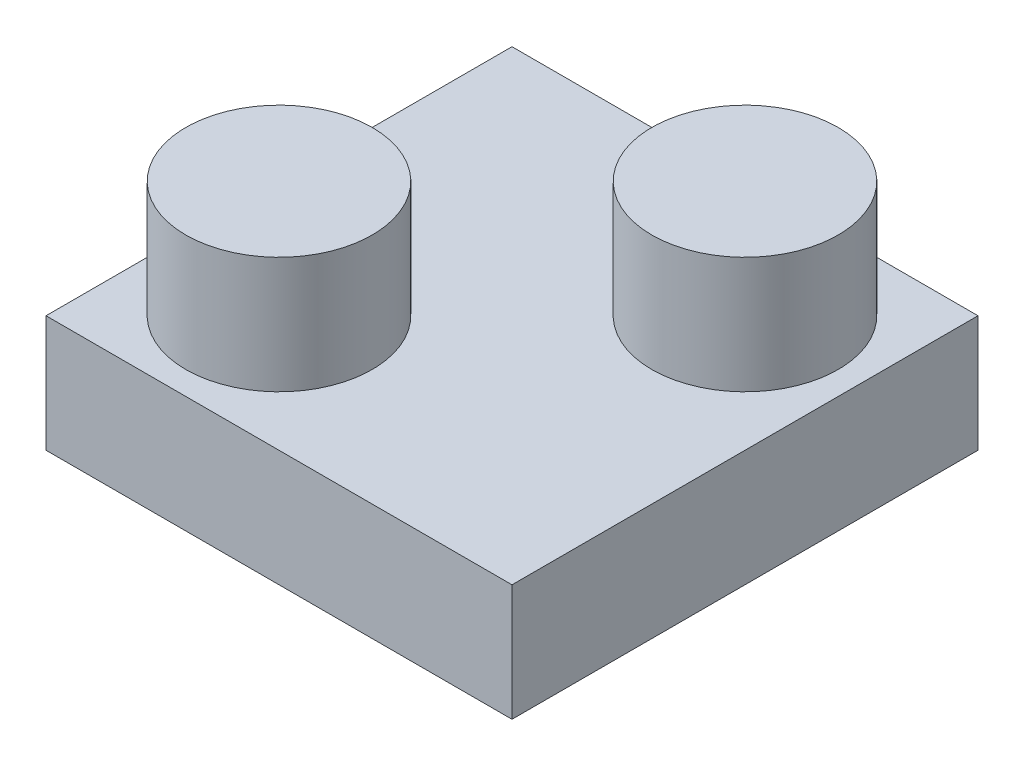
ISO-10303-21;
HEADER;
FILE_DESCRIPTION(('STEP AP214'),'2;1');
FILE_NAME('part.step','',(''),(''),'','','');
FILE_SCHEMA(('AUTOMOTIVE_DESIGN { 1 0 10303 214 1 1 1 1 }'));
ENDSEC;
DATA;
#1=APPLICATION_CONTEXT('core data for automotive mechanical design processes');
#2=APPLICATION_PROTOCOL_DEFINITION('international standard','automotive_design',2000,#1);
#3=PRODUCT_CONTEXT('',#1,'mechanical');
#4=PRODUCT('Part','Part','',(#3));
#5=PRODUCT_RELATED_PRODUCT_CATEGORY('part','',(#4));
#6=PRODUCT_DEFINITION_FORMATION('','',#4);
#7=PRODUCT_DEFINITION_CONTEXT('part definition',#1,'design');
#8=PRODUCT_DEFINITION('design','',#6,#7);
#9=PRODUCT_DEFINITION_SHAPE('','',#8);
#10=(LENGTH_UNIT() NAMED_UNIT(*) SI_UNIT(.MILLI.,.METRE.));
#11=(NAMED_UNIT(*) PLANE_ANGLE_UNIT() SI_UNIT($,.RADIAN.));
#12=(NAMED_UNIT(*) SI_UNIT($,.STERADIAN.) SOLID_ANGLE_UNIT());
#13=UNCERTAINTY_MEASURE_WITH_UNIT(LENGTH_MEASURE(1.E-05),#10,'distance_accuracy_value','');
#14=(GEOMETRIC_REPRESENTATION_CONTEXT(3) GLOBAL_UNCERTAINTY_ASSIGNED_CONTEXT((#13)) GLOBAL_UNIT_ASSIGNED_CONTEXT((#10,
#11,#12)) REPRESENTATION_CONTEXT('',''));
#15=CARTESIAN_POINT('',(0.,0.,0.));
#16=DIRECTION('',(0.,0.,1.));
#17=DIRECTION('',(1.,0.,0.));
#18=AXIS2_PLACEMENT_3D('',#15,#16,#17);
#19=CARTESIAN_POINT('',(-5.,5.,5.));
#20=DIRECTION('',(1.,0.,0.));
#21=DIRECTION('',(0.,0.,-1.));
#22=AXIS2_PLACEMENT_3D('',#19,#20,#21);
#23=PLANE('',#22);
#24=DIRECTION('',(0.,-1.,0.));
#25=VECTOR('',#24,1.);
#26=CARTESIAN_POINT('',(-5.,5.,5.));
#27=LINE('',#26,#25);
#28=CARTESIAN_POINT('',(-5.,2.5,5.));
#29=VERTEX_POINT('',#28);
#30=CARTESIAN_POINT('',(-5.,0.,5.));
#31=VERTEX_POINT('',#30);
#32=EDGE_CURVE('E11',#29,#31,#27,.T.);
#33=ORIENTED_EDGE('',*,*,#32,.F.);
#34=DIRECTION('',(0.,0.,1.));
#35=VECTOR('',#34,1.);
#36=CARTESIAN_POINT('',(-5.,2.5,5.));
#37=LINE('',#36,#35);
#38=CARTESIAN_POINT('',(-5.,2.5,-5.));
#39=VERTEX_POINT('',#38);
#40=EDGE_CURVE('E79',#39,#29,#37,.T.);
#41=ORIENTED_EDGE('',*,*,#40,.F.);
#42=DIRECTION('',(0.,-1.,0.));
#43=VECTOR('',#42,1.);
#44=CARTESIAN_POINT('',(-5.,5.,-5.));
#45=LINE('',#44,#43);
#46=CARTESIAN_POINT('',(-5.,0.,-5.));
#47=VERTEX_POINT('',#46);
#48=EDGE_CURVE('E61',#39,#47,#45,.T.);
#49=ORIENTED_EDGE('',*,*,#48,.T.);
#50=DIRECTION('',(0.,0.,1.));
#51=VECTOR('',#50,1.);
#52=CARTESIAN_POINT('',(-5.,0.,5.));
#53=LINE('',#52,#51);
#54=EDGE_CURVE('E116',#47,#31,#53,.T.);
#55=ORIENTED_EDGE('',*,*,#54,.T.);
#56=EDGE_LOOP('',(#33,#41,#49,#55));
#57=FACE_BOUND('',#56,.T.);
#58=ADVANCED_FACE('F38',(#57),#23,.F.);
#59=CARTESIAN_POINT('',(5.,5.,5.));
#60=DIRECTION('',(0.,0.,-1.));
#61=DIRECTION('',(-1.,0.,0.));
#62=AXIS2_PLACEMENT_3D('',#59,#60,#61);
#63=PLANE('',#62);
#64=DIRECTION('',(0.,-1.,0.));
#65=VECTOR('',#64,1.);
#66=CARTESIAN_POINT('',(5.,5.,5.));
#67=LINE('',#66,#65);
#68=CARTESIAN_POINT('',(5.,2.5,5.));
#69=VERTEX_POINT('',#68);
#70=CARTESIAN_POINT('',(5.,0.,5.));
#71=VERTEX_POINT('',#70);
#72=EDGE_CURVE('E46',#69,#71,#67,.T.);
#73=ORIENTED_EDGE('',*,*,#72,.F.);
#74=DIRECTION('',(1.,0.,0.));
#75=VECTOR('',#74,1.);
#76=CARTESIAN_POINT('',(5.,2.5,5.));
#77=LINE('',#76,#75);
#78=EDGE_CURVE('E88',#29,#69,#77,.T.);
#79=ORIENTED_EDGE('',*,*,#78,.F.);
#80=ORIENTED_EDGE('',*,*,#32,.T.);
#81=DIRECTION('',(1.,0.,0.));
#82=VECTOR('',#81,1.);
#83=CARTESIAN_POINT('',(5.,0.,5.));
#84=LINE('',#83,#82);
#85=EDGE_CURVE('E112',#31,#71,#84,.T.);
#86=ORIENTED_EDGE('',*,*,#85,.T.);
#87=EDGE_LOOP('',(#73,#79,#80,#86));
#88=FACE_BOUND('',#87,.T.);
#89=ADVANCED_FACE('F113',(#88),#63,.F.);
#90=CARTESIAN_POINT('',(5.,5.,5.));
#91=DIRECTION('',(-1.,0.,0.));
#92=DIRECTION('',(0.,0.,1.));
#93=AXIS2_PLACEMENT_3D('',#90,#91,#92);
#94=PLANE('',#93);
#95=DIRECTION('',(0.,-1.,0.));
#96=VECTOR('',#95,1.);
#97=CARTESIAN_POINT('',(5.,5.,-5.));
#98=LINE('',#97,#96);
#99=CARTESIAN_POINT('',(5.,2.5,-5.));
#100=VERTEX_POINT('',#99);
#101=CARTESIAN_POINT('',(5.,0.,-5.));
#102=VERTEX_POINT('',#101);
#103=EDGE_CURVE('E95',#100,#102,#98,.T.);
#104=ORIENTED_EDGE('',*,*,#103,.F.);
#105=DIRECTION('',(0.,0.,-1.));
#106=VECTOR('',#105,1.);
#107=CARTESIAN_POINT('',(5.,2.5,5.));
#108=LINE('',#107,#106);
#109=EDGE_CURVE('E53',#69,#100,#108,.T.);
#110=ORIENTED_EDGE('',*,*,#109,.F.);
#111=ORIENTED_EDGE('',*,*,#72,.T.);
#112=DIRECTION('',(0.,0.,-1.));
#113=VECTOR('',#112,1.);
#114=CARTESIAN_POINT('',(5.,0.,5.));
#115=LINE('',#114,#113);
#116=EDGE_CURVE('E100',#71,#102,#115,.T.);
#117=ORIENTED_EDGE('',*,*,#116,.T.);
#118=EDGE_LOOP('',(#104,#110,#111,#117));
#119=FACE_BOUND('',#118,.T.);
#120=ADVANCED_FACE('F108',(#119),#94,.F.);
#121=CARTESIAN_POINT('',(5.,5.,-5.));
#122=DIRECTION('',(0.,0.,1.));
#123=DIRECTION('',(1.,0.,0.));
#124=AXIS2_PLACEMENT_3D('',#121,#122,#123);
#125=PLANE('',#124);
#126=ORIENTED_EDGE('',*,*,#48,.F.);
#127=DIRECTION('',(-1.,0.,0.));
#128=VECTOR('',#127,1.);
#129=CARTESIAN_POINT('',(5.,2.5,-5.));
#130=LINE('',#129,#128);
#131=EDGE_CURVE('E77',#100,#39,#130,.T.);
#132=ORIENTED_EDGE('',*,*,#131,.F.);
#133=ORIENTED_EDGE('',*,*,#103,.T.);
#134=DIRECTION('',(-1.,0.,0.));
#135=VECTOR('',#134,1.);
#136=CARTESIAN_POINT('',(5.,0.,-5.));
#137=LINE('',#136,#135);
#138=EDGE_CURVE('E92',#102,#47,#137,.T.);
#139=ORIENTED_EDGE('',*,*,#138,.T.);
#140=EDGE_LOOP('',(#126,#132,#133,#139));
#141=FACE_BOUND('',#140,.T.);
#142=ADVANCED_FACE('F90',(#141),#125,.F.);
#143=CARTESIAN_POINT('',(0.,0.,0.));
#144=DIRECTION('',(0.,1.,0.));
#145=DIRECTION('',(0.,0.,1.));
#146=AXIS2_PLACEMENT_3D('',#143,#144,#145);
#147=PLANE('',#146);
#148=ORIENTED_EDGE('',*,*,#54,.F.);
#149=ORIENTED_EDGE('',*,*,#138,.F.);
#150=ORIENTED_EDGE('',*,*,#116,.F.);
#151=ORIENTED_EDGE('',*,*,#85,.F.);
#152=EDGE_LOOP('',(#148,#149,#150,#151));
#153=FACE_BOUND('',#152,.T.);
#154=ADVANCED_FACE('F118',(#153),#147,.F.);
#155=CARTESIAN_POINT('',(0.,2.5,0.));
#156=DIRECTION('',(0.,-1.,0.));
#157=DIRECTION('',(0.,0.,-1.));
#158=AXIS2_PLACEMENT_3D('',#155,#156,#157);
#159=PLANE('',#158);
#160=CARTESIAN_POINT('',(2.5,2.5,-2.5));
#161=DIRECTION('',(0.,1.,0.));
#162=DIRECTION('',(0.,0.,1.));
#163=AXIS2_PLACEMENT_3D('',#160,#161,#162);
#164=CIRCLE('',#163,2.);
#165=CARTESIAN_POINT('',(2.5,2.5,-0.5));
#166=VERTEX_POINT('',#165);
#167=EDGE_CURVE('E131',#166,#166,#164,.T.);
#168=ORIENTED_EDGE('',*,*,#167,.F.);
#169=EDGE_LOOP('',(#168));
#170=FACE_BOUND('',#169,.T.);
#171=CARTESIAN_POINT('',(-2.5,2.5,2.5));
#172=DIRECTION('',(0.,1.,0.));
#173=DIRECTION('',(0.,0.,1.));
#174=AXIS2_PLACEMENT_3D('',#171,#172,#173);
#175=CIRCLE('',#174,2.);
#176=CARTESIAN_POINT('',(-2.5,2.5,4.5));
#177=VERTEX_POINT('',#176);
#178=EDGE_CURVE('E84',#177,#177,#175,.T.);
#179=ORIENTED_EDGE('',*,*,#178,.F.);
#180=EDGE_LOOP('',(#179));
#181=FACE_BOUND('',#180,.T.);
#182=ORIENTED_EDGE('',*,*,#131,.T.);
#183=ORIENTED_EDGE('',*,*,#40,.T.);
#184=ORIENTED_EDGE('',*,*,#78,.T.);
#185=ORIENTED_EDGE('',*,*,#109,.T.);
#186=EDGE_LOOP('',(#182,#183,#184,#185));
#187=FACE_BOUND('',#186,.T.);
#188=ADVANCED_FACE('F78',(#170,#181,#187),#159,.F.);
#189=CARTESIAN_POINT('',(-2.5,2.5,2.5));
#190=DIRECTION('',(0.,1.,0.));
#191=DIRECTION('',(0.,0.,1.));
#192=AXIS2_PLACEMENT_3D('',#189,#190,#191);
#193=CYLINDRICAL_SURFACE('',#192,2.);
#194=ORIENTED_EDGE('',*,*,#178,.T.);
#195=EDGE_LOOP('',(#194));
#196=FACE_BOUND('',#195,.T.);
#197=CARTESIAN_POINT('',(-2.5,5.,2.5));
#198=DIRECTION('',(0.,1.,0.));
#199=DIRECTION('',(0.,0.,1.));
#200=AXIS2_PLACEMENT_3D('',#197,#198,#199);
#201=CIRCLE('',#200,2.);
#202=CARTESIAN_POINT('',(-2.5,5.,4.5));
#203=VERTEX_POINT('',#202);
#204=EDGE_CURVE('E127',#203,#203,#201,.T.);
#205=ORIENTED_EDGE('',*,*,#204,.F.);
#206=EDGE_LOOP('',(#205));
#207=FACE_BOUND('',#206,.T.);
#208=ADVANCED_FACE('F148',(#196,#207),#193,.T.);
#209=CARTESIAN_POINT('',(2.5,2.5,-2.5));
#210=DIRECTION('',(0.,1.,0.));
#211=DIRECTION('',(0.,0.,1.));
#212=AXIS2_PLACEMENT_3D('',#209,#210,#211);
#213=CYLINDRICAL_SURFACE('',#212,2.);
#214=ORIENTED_EDGE('',*,*,#167,.T.);
#215=EDGE_LOOP('',(#214));
#216=FACE_BOUND('',#215,.T.);
#217=CARTESIAN_POINT('',(2.5,5.,-2.5));
#218=DIRECTION('',(0.,1.,0.));
#219=DIRECTION('',(0.,0.,1.));
#220=AXIS2_PLACEMENT_3D('',#217,#218,#219);
#221=CIRCLE('',#220,2.);
#222=CARTESIAN_POINT('',(2.5,5.,-0.5));
#223=VERTEX_POINT('',#222);
#224=EDGE_CURVE('E135',#223,#223,#221,.T.);
#225=ORIENTED_EDGE('',*,*,#224,.F.);
#226=EDGE_LOOP('',(#225));
#227=FACE_BOUND('',#226,.T.);
#228=ADVANCED_FACE('F143',(#216,#227),#213,.T.);
#229=CARTESIAN_POINT('',(0.,5.,0.));
#230=DIRECTION('',(0.,1.,0.));
#231=DIRECTION('',(0.,0.,1.));
#232=AXIS2_PLACEMENT_3D('',#229,#230,#231);
#233=PLANE('',#232);
#234=ORIENTED_EDGE('',*,*,#204,.T.);
#235=EDGE_LOOP('',(#234));
#236=FACE_BOUND('',#235,.T.);
#237=ADVANCED_FACE('F157',(#236),#233,.T.);
#238=ORIENTED_EDGE('',*,*,#224,.T.);
#239=EDGE_LOOP('',(#238));
#240=FACE_BOUND('',#239,.T.);
#241=ADVANCED_FACE('F159',(#240),#233,.T.);
#242=CLOSED_SHELL('',(#58,#89,#120,#142,#154,#188,#208,#228,#237,#241));
#243=MANIFOLD_SOLID_BREP('B2',#242);
#244=ADVANCED_BREP_SHAPE_REPRESENTATION('',(#18,#243),#14);
#245=SHAPE_DEFINITION_REPRESENTATION(#9,#244);
ENDSEC;
END-ISO-10303-21;
